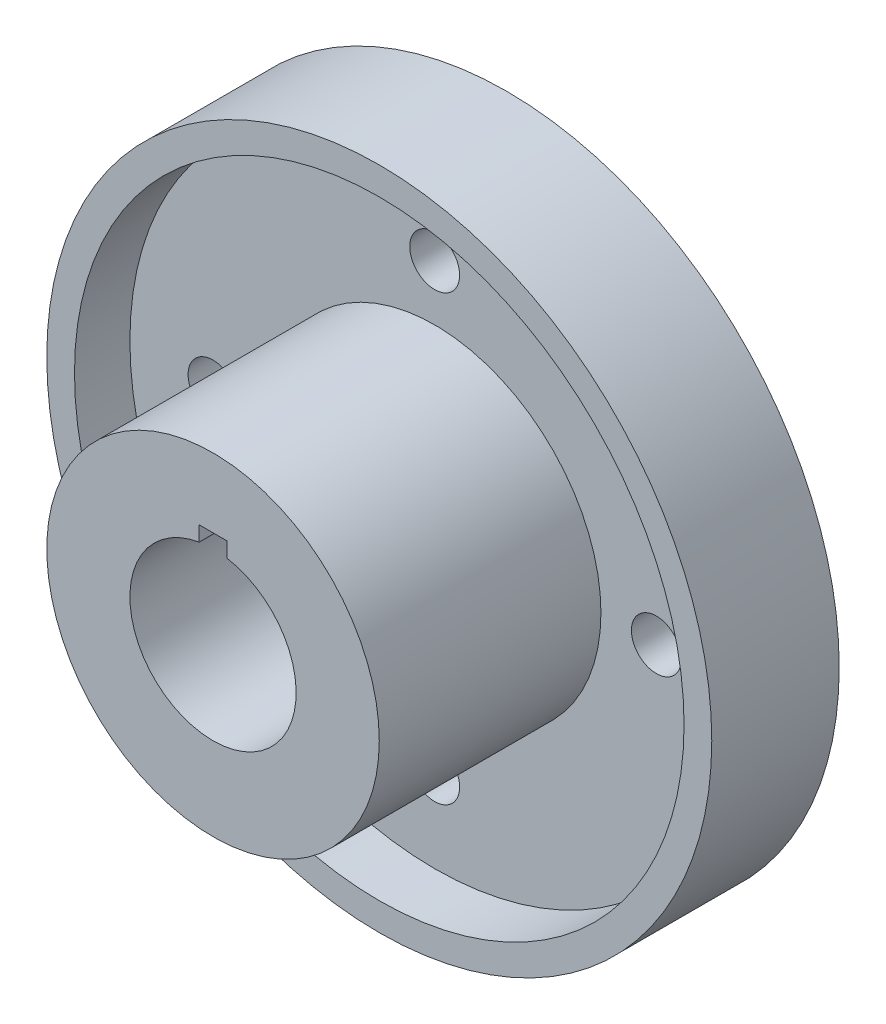
ISO-10303-21;
HEADER;
FILE_DESCRIPTION(('STEP AP214'),'2;1');
FILE_NAME('part.step','',(''),(''),'','','');
FILE_SCHEMA(('AUTOMOTIVE_DESIGN { 1 0 10303 214 1 1 1 1 }'));
ENDSEC;
DATA;
#1=APPLICATION_CONTEXT('core data for automotive mechanical design processes');
#2=APPLICATION_PROTOCOL_DEFINITION('international standard','automotive_design',2000,#1);
#3=PRODUCT_CONTEXT('',#1,'mechanical');
#4=PRODUCT('Part','Part','',(#3));
#5=PRODUCT_RELATED_PRODUCT_CATEGORY('part','',(#4));
#6=PRODUCT_DEFINITION_FORMATION('','',#4);
#7=PRODUCT_DEFINITION_CONTEXT('part definition',#1,'design');
#8=PRODUCT_DEFINITION('design','',#6,#7);
#9=PRODUCT_DEFINITION_SHAPE('','',#8);
#10=(LENGTH_UNIT() NAMED_UNIT(*) SI_UNIT(.MILLI.,.METRE.));
#11=(NAMED_UNIT(*) PLANE_ANGLE_UNIT() SI_UNIT($,.RADIAN.));
#12=(NAMED_UNIT(*) SI_UNIT($,.STERADIAN.) SOLID_ANGLE_UNIT());
#13=UNCERTAINTY_MEASURE_WITH_UNIT(LENGTH_MEASURE(1.E-05),#10,'distance_accuracy_value','');
#14=(GEOMETRIC_REPRESENTATION_CONTEXT(3) GLOBAL_UNCERTAINTY_ASSIGNED_CONTEXT((#13)) GLOBAL_UNIT_ASSIGNED_CONTEXT((#10,
#11,#12)) REPRESENTATION_CONTEXT('',''));
#15=CARTESIAN_POINT('',(0.,0.,0.));
#16=DIRECTION('',(0.,0.,1.));
#17=DIRECTION('',(1.,0.,0.));
#18=AXIS2_PLACEMENT_3D('',#15,#16,#17);
#19=CARTESIAN_POINT('',(0.,15.,53.));
#20=DIRECTION('',(0.,0.,-1.));
#21=DIRECTION('',(-1.,0.,0.));
#22=AXIS2_PLACEMENT_3D('',#19,#20,#21);
#23=PLANE('',#22);
#24=CARTESIAN_POINT('',(0.,0.,53.));
#25=DIRECTION('',(0.,0.,1.));
#26=DIRECTION('',(1.,0.,0.));
#27=AXIS2_PLACEMENT_3D('',#24,#25,#26);
#28=CIRCLE('',#27,15.);
#29=CARTESIAN_POINT('',(-2.5,14.790199457749,53.));
#30=VERTEX_POINT('',#29);
#31=CARTESIAN_POINT('',(2.5,14.790199457749,53.));
#32=VERTEX_POINT('',#31);
#33=EDGE_CURVE('E124',#30,#32,#28,.T.);
#34=ORIENTED_EDGE('',*,*,#33,.F.);
#35=DIRECTION('',(0.,-1.,0.));
#36=VECTOR('',#35,1.);
#37=CARTESIAN_POINT('',(-2.5,12.5,53.));
#38=LINE('',#37,#36);
#39=CARTESIAN_POINT('',(-2.5,17.5,53.));
#40=VERTEX_POINT('',#39);
#41=EDGE_CURVE('E109',#40,#30,#38,.T.);
#42=ORIENTED_EDGE('',*,*,#41,.F.);
#43=DIRECTION('',(-1.,0.,0.));
#44=VECTOR('',#43,1.);
#45=CARTESIAN_POINT('',(-2.5,17.5,53.));
#46=LINE('',#45,#44);
#47=CARTESIAN_POINT('',(2.5,17.5,53.));
#48=VERTEX_POINT('',#47);
#49=EDGE_CURVE('E96',#48,#40,#46,.T.);
#50=ORIENTED_EDGE('',*,*,#49,.F.);
#51=DIRECTION('',(0.,1.,0.));
#52=VECTOR('',#51,1.);
#53=CARTESIAN_POINT('',(2.5,12.5,53.));
#54=LINE('',#53,#52);
#55=EDGE_CURVE('E102',#32,#48,#54,.T.);
#56=ORIENTED_EDGE('',*,*,#55,.F.);
#57=EDGE_LOOP('',(#34,#42,#50,#56));
#58=FACE_BOUND('',#57,.T.);
#59=CARTESIAN_POINT('',(0.,0.,53.));
#60=DIRECTION('',(0.,0.,1.));
#61=DIRECTION('',(1.,0.,0.));
#62=AXIS2_PLACEMENT_3D('',#59,#60,#61);
#63=CIRCLE('',#62,30.);
#64=CARTESIAN_POINT('',(30.,0.,53.));
#65=VERTEX_POINT('',#64);
#66=EDGE_CURVE('E159',#65,#65,#63,.T.);
#67=ORIENTED_EDGE('',*,*,#66,.T.);
#68=EDGE_LOOP('',(#67));
#69=FACE_BOUND('',#68,.T.);
#70=ADVANCED_FACE('F49',(#58,#69),#23,.F.);
#71=CARTESIAN_POINT('',(0.,0.,0.));
#72=DIRECTION('',(0.,0.,1.));
#73=DIRECTION('',(1.,0.,0.));
#74=AXIS2_PLACEMENT_3D('',#71,#72,#73);
#75=CYLINDRICAL_SURFACE('',#74,30.);
#76=ORIENTED_EDGE('',*,*,#66,.F.);
#77=EDGE_LOOP('',(#76));
#78=FACE_BOUND('',#77,.T.);
#79=CARTESIAN_POINT('',(0.,0.,13.));
#80=DIRECTION('',(0.,0.,1.));
#81=DIRECTION('',(1.,0.,0.));
#82=AXIS2_PLACEMENT_3D('',#79,#80,#81);
#83=CIRCLE('',#82,30.);
#84=CARTESIAN_POINT('',(30.,0.,13.));
#85=VERTEX_POINT('',#84);
#86=EDGE_CURVE('E155',#85,#85,#83,.T.);
#87=ORIENTED_EDGE('',*,*,#86,.T.);
#88=EDGE_LOOP('',(#87));
#89=FACE_BOUND('',#88,.T.);
#90=ADVANCED_FACE('F222',(#78,#89),#75,.T.);
#91=CARTESIAN_POINT('',(0.,30.,13.));
#92=DIRECTION('',(0.,0.,-1.));
#93=DIRECTION('',(-1.,0.,0.));
#94=AXIS2_PLACEMENT_3D('',#91,#92,#93);
#95=PLANE('',#94);
#96=CARTESIAN_POINT('',(40.,4.18977760661176E-13,13.));
#97=DIRECTION('',(0.,0.,1.));
#98=DIRECTION('',(1.,0.,0.));
#99=AXIS2_PLACEMENT_3D('',#96,#97,#98);
#100=CIRCLE('',#99,4.49999999999999);
#101=CARTESIAN_POINT('',(44.5,4.18977760661176E-13,13.));
#102=VERTEX_POINT('',#101);
#103=EDGE_CURVE('E194',#102,#102,#100,.T.);
#104=ORIENTED_EDGE('',*,*,#103,.F.);
#105=EDGE_LOOP('',(#104));
#106=FACE_BOUND('',#105,.T.);
#107=CARTESIAN_POINT('',(0.,-40.,13.));
#108=DIRECTION('',(0.,0.,1.));
#109=DIRECTION('',(1.,0.,0.));
#110=AXIS2_PLACEMENT_3D('',#107,#108,#109);
#111=CIRCLE('',#110,4.49999999999999);
#112=CARTESIAN_POINT('',(4.49999999999999,-40.,13.));
#113=VERTEX_POINT('',#112);
#114=EDGE_CURVE('E179',#113,#113,#111,.T.);
#115=ORIENTED_EDGE('',*,*,#114,.F.);
#116=EDGE_LOOP('',(#115));
#117=FACE_BOUND('',#116,.T.);
#118=CARTESIAN_POINT('',(-40.,-1.39659253553725E-13,13.));
#119=DIRECTION('',(0.,0.,1.));
#120=DIRECTION('',(1.,0.,0.));
#121=AXIS2_PLACEMENT_3D('',#118,#119,#120);
#122=CIRCLE('',#121,4.49999999999999);
#123=CARTESIAN_POINT('',(-35.5,-1.39659253553725E-13,13.));
#124=VERTEX_POINT('',#123);
#125=EDGE_CURVE('E175',#124,#124,#122,.T.);
#126=ORIENTED_EDGE('',*,*,#125,.F.);
#127=EDGE_LOOP('',(#126));
#128=FACE_BOUND('',#127,.T.);
#129=CARTESIAN_POINT('',(0.,40.,13.));
#130=DIRECTION('',(0.,0.,1.));
#131=DIRECTION('',(1.,0.,0.));
#132=AXIS2_PLACEMENT_3D('',#129,#130,#131);
#133=CIRCLE('',#132,4.49999999999999);
#134=CARTESIAN_POINT('',(4.49999999999999,40.,13.));
#135=VERTEX_POINT('',#134);
#136=EDGE_CURVE('E171',#135,#135,#133,.T.);
#137=ORIENTED_EDGE('',*,*,#136,.F.);
#138=EDGE_LOOP('',(#137));
#139=FACE_BOUND('',#138,.T.);
#140=ORIENTED_EDGE('',*,*,#86,.F.);
#141=EDGE_LOOP('',(#140));
#142=FACE_BOUND('',#141,.T.);
#143=CARTESIAN_POINT('',(0.,0.,13.));
#144=DIRECTION('',(0.,0.,1.));
#145=DIRECTION('',(1.,0.,0.));
#146=AXIS2_PLACEMENT_3D('',#143,#144,#145);
#147=CIRCLE('',#146,55.);
#148=CARTESIAN_POINT('',(55.,0.,13.));
#149=VERTEX_POINT('',#148);
#150=EDGE_CURVE('E151',#149,#149,#147,.T.);
#151=ORIENTED_EDGE('',*,*,#150,.T.);
#152=EDGE_LOOP('',(#151));
#153=FACE_BOUND('',#152,.T.);
#154=ADVANCED_FACE('F226',(#106,#117,#128,#139,#142,#153),#95,.F.);
#155=CARTESIAN_POINT('',(0.,0.,0.));
#156=DIRECTION('',(0.,0.,1.));
#157=DIRECTION('',(1.,0.,0.));
#158=AXIS2_PLACEMENT_3D('',#155,#156,#157);
#159=CYLINDRICAL_SURFACE('',#158,55.);
#160=ORIENTED_EDGE('',*,*,#150,.F.);
#161=EDGE_LOOP('',(#160));
#162=FACE_BOUND('',#161,.T.);
#163=CARTESIAN_POINT('',(0.,0.,23.));
#164=DIRECTION('',(0.,0.,1.));
#165=DIRECTION('',(1.,0.,0.));
#166=AXIS2_PLACEMENT_3D('',#163,#164,#165);
#167=CIRCLE('',#166,55.);
#168=CARTESIAN_POINT('',(55.,0.,23.));
#169=VERTEX_POINT('',#168);
#170=EDGE_CURVE('E147',#169,#169,#167,.T.);
#171=ORIENTED_EDGE('',*,*,#170,.T.);
#172=EDGE_LOOP('',(#171));
#173=FACE_BOUND('',#172,.T.);
#174=ADVANCED_FACE('F231',(#162,#173),#159,.F.);
#175=CARTESIAN_POINT('',(0.,55.,23.));
#176=DIRECTION('',(0.,0.,-1.));
#177=DIRECTION('',(-1.,0.,0.));
#178=AXIS2_PLACEMENT_3D('',#175,#176,#177);
#179=PLANE('',#178);
#180=ORIENTED_EDGE('',*,*,#170,.F.);
#181=EDGE_LOOP('',(#180));
#182=FACE_BOUND('',#181,.T.);
#183=CARTESIAN_POINT('',(0.,0.,23.));
#184=DIRECTION('',(0.,0.,1.));
#185=DIRECTION('',(1.,0.,0.));
#186=AXIS2_PLACEMENT_3D('',#183,#184,#185);
#187=CIRCLE('',#186,60.);
#188=CARTESIAN_POINT('',(60.,0.,23.));
#189=VERTEX_POINT('',#188);
#190=EDGE_CURVE('E143',#189,#189,#187,.T.);
#191=ORIENTED_EDGE('',*,*,#190,.T.);
#192=EDGE_LOOP('',(#191));
#193=FACE_BOUND('',#192,.T.);
#194=ADVANCED_FACE('F238',(#182,#193),#179,.F.);
#195=CARTESIAN_POINT('',(0.,0.,0.));
#196=DIRECTION('',(0.,0.,1.));
#197=DIRECTION('',(1.,0.,0.));
#198=AXIS2_PLACEMENT_3D('',#195,#196,#197);
#199=CYLINDRICAL_SURFACE('',#198,60.);
#200=ORIENTED_EDGE('',*,*,#190,.F.);
#201=EDGE_LOOP('',(#200));
#202=FACE_BOUND('',#201,.T.);
#203=CARTESIAN_POINT('',(0.,0.,0.));
#204=DIRECTION('',(0.,0.,1.));
#205=DIRECTION('',(1.,0.,0.));
#206=AXIS2_PLACEMENT_3D('',#203,#204,#205);
#207=CIRCLE('',#206,60.);
#208=CARTESIAN_POINT('',(60.,0.,0.));
#209=VERTEX_POINT('',#208);
#210=EDGE_CURVE('E139',#209,#209,#207,.T.);
#211=ORIENTED_EDGE('',*,*,#210,.T.);
#212=EDGE_LOOP('',(#211));
#213=FACE_BOUND('',#212,.T.);
#214=ADVANCED_FACE('F242',(#202,#213),#199,.T.);
#215=CARTESIAN_POINT('',(0.,60.,0.));
#216=DIRECTION('',(0.,0.,1.));
#217=DIRECTION('',(1.,0.,0.));
#218=AXIS2_PLACEMENT_3D('',#215,#216,#217);
#219=PLANE('',#218);
#220=ORIENTED_EDGE('',*,*,#210,.F.);
#221=EDGE_LOOP('',(#220));
#222=FACE_BOUND('',#221,.T.);
#223=CARTESIAN_POINT('',(0.,0.,0.));
#224=DIRECTION('',(0.,0.,1.));
#225=DIRECTION('',(1.,0.,0.));
#226=AXIS2_PLACEMENT_3D('',#223,#224,#225);
#227=CIRCLE('',#226,55.);
#228=CARTESIAN_POINT('',(55.,0.,0.));
#229=VERTEX_POINT('',#228);
#230=EDGE_CURVE('E135',#229,#229,#227,.T.);
#231=ORIENTED_EDGE('',*,*,#230,.T.);
#232=EDGE_LOOP('',(#231));
#233=FACE_BOUND('',#232,.T.);
#234=ADVANCED_FACE('F218',(#222,#233),#219,.F.);
#235=CARTESIAN_POINT('',(0.,0.,0.));
#236=DIRECTION('',(0.,0.,1.));
#237=DIRECTION('',(1.,0.,0.));
#238=AXIS2_PLACEMENT_3D('',#235,#236,#237);
#239=CYLINDRICAL_SURFACE('',#238,55.);
#240=ORIENTED_EDGE('',*,*,#230,.F.);
#241=EDGE_LOOP('',(#240));
#242=FACE_BOUND('',#241,.T.);
#243=CARTESIAN_POINT('',(0.,0.,3.));
#244=DIRECTION('',(0.,0.,1.));
#245=DIRECTION('',(1.,0.,0.));
#246=AXIS2_PLACEMENT_3D('',#243,#244,#245);
#247=CIRCLE('',#246,55.);
#248=CARTESIAN_POINT('',(55.,0.,3.));
#249=VERTEX_POINT('',#248);
#250=EDGE_CURVE('E131',#249,#249,#247,.T.);
#251=ORIENTED_EDGE('',*,*,#250,.T.);
#252=EDGE_LOOP('',(#251));
#253=FACE_BOUND('',#252,.T.);
#254=ADVANCED_FACE('F208',(#242,#253),#239,.F.);
#255=CARTESIAN_POINT('',(0.,33.885514375046,2.99999999999999));
#256=DIRECTION('',(0.,0.,1.));
#257=DIRECTION('',(1.,0.,0.));
#258=AXIS2_PLACEMENT_3D('',#255,#256,#257);
#259=PLANE('',#258);
#260=CARTESIAN_POINT('',(40.,4.18977760661176E-13,3.));
#261=DIRECTION('',(0.,0.,1.));
#262=DIRECTION('',(1.,0.,0.));
#263=AXIS2_PLACEMENT_3D('',#260,#261,#262);
#264=CIRCLE('',#263,4.49999999999999);
#265=CARTESIAN_POINT('',(44.5,4.18977760661176E-13,3.));
#266=VERTEX_POINT('',#265);
#267=EDGE_CURVE('E52',#266,#266,#264,.T.);
#268=ORIENTED_EDGE('',*,*,#267,.T.);
#269=EDGE_LOOP('',(#268));
#270=FACE_BOUND('',#269,.T.);
#271=CARTESIAN_POINT('',(0.,-40.,3.));
#272=DIRECTION('',(0.,0.,1.));
#273=DIRECTION('',(1.,0.,0.));
#274=AXIS2_PLACEMENT_3D('',#271,#272,#273);
#275=CIRCLE('',#274,4.49999999999999);
#276=CARTESIAN_POINT('',(4.49999999999999,-40.,3.));
#277=VERTEX_POINT('',#276);
#278=EDGE_CURVE('E176',#277,#277,#275,.T.);
#279=ORIENTED_EDGE('',*,*,#278,.T.);
#280=EDGE_LOOP('',(#279));
#281=FACE_BOUND('',#280,.T.);
#282=CARTESIAN_POINT('',(-40.,-1.39659253553725E-13,3.));
#283=DIRECTION('',(0.,0.,1.));
#284=DIRECTION('',(1.,0.,0.));
#285=AXIS2_PLACEMENT_3D('',#282,#283,#284);
#286=CIRCLE('',#285,4.49999999999999);
#287=CARTESIAN_POINT('',(-35.5,-1.39659253553725E-13,3.));
#288=VERTEX_POINT('',#287);
#289=EDGE_CURVE('E172',#288,#288,#286,.T.);
#290=ORIENTED_EDGE('',*,*,#289,.T.);
#291=EDGE_LOOP('',(#290));
#292=FACE_BOUND('',#291,.T.);
#293=CARTESIAN_POINT('',(0.,40.,3.));
#294=DIRECTION('',(0.,0.,1.));
#295=DIRECTION('',(1.,0.,0.));
#296=AXIS2_PLACEMENT_3D('',#293,#294,#295);
#297=CIRCLE('',#296,4.49999999999999);
#298=CARTESIAN_POINT('',(4.49999999999999,40.,3.));
#299=VERTEX_POINT('',#298);
#300=EDGE_CURVE('E167',#299,#299,#297,.T.);
#301=ORIENTED_EDGE('',*,*,#300,.T.);
#302=EDGE_LOOP('',(#301));
#303=FACE_BOUND('',#302,.T.);
#304=ORIENTED_EDGE('',*,*,#250,.F.);
#305=EDGE_LOOP('',(#304));
#306=FACE_BOUND('',#305,.T.);
#307=DIRECTION('',(-1.,0.,0.));
#308=VECTOR('',#307,1.);
#309=CARTESIAN_POINT('',(0.,17.5,2.99999999999999));
#310=LINE('',#309,#308);
#311=CARTESIAN_POINT('',(2.5,17.5,2.99999999999999));
#312=VERTEX_POINT('',#311);
#313=CARTESIAN_POINT('',(-2.5,17.5,2.99999999999999));
#314=VERTEX_POINT('',#313);
#315=EDGE_CURVE('E11',#312,#314,#310,.T.);
#316=ORIENTED_EDGE('',*,*,#315,.T.);
#317=DIRECTION('',(0.,-1.,0.));
#318=VECTOR('',#317,1.);
#319=CARTESIAN_POINT('',(-2.5,33.885514375046,2.99999999999999));
#320=LINE('',#319,#318);
#321=CARTESIAN_POINT('',(-2.5,14.790199457749,2.99999999999999));
#322=VERTEX_POINT('',#321);
#323=EDGE_CURVE('E121',#314,#322,#320,.T.);
#324=ORIENTED_EDGE('',*,*,#323,.T.);
#325=CARTESIAN_POINT('',(0.,0.,2.99999999999999));
#326=DIRECTION('',(0.,0.,1.));
#327=DIRECTION('',(1.,0.,0.));
#328=AXIS2_PLACEMENT_3D('',#325,#326,#327);
#329=CIRCLE('',#328,15.);
#330=CARTESIAN_POINT('',(2.5,14.790199457749,2.99999999999999));
#331=VERTEX_POINT('',#330);
#332=EDGE_CURVE('E127',#322,#331,#329,.T.);
#333=ORIENTED_EDGE('',*,*,#332,.T.);
#334=DIRECTION('',(0.,1.,0.));
#335=VECTOR('',#334,1.);
#336=CARTESIAN_POINT('',(2.5,33.885514375046,2.99999999999999));
#337=LINE('',#336,#335);
#338=EDGE_CURVE('E66',#331,#312,#337,.T.);
#339=ORIENTED_EDGE('',*,*,#338,.T.);
#340=EDGE_LOOP('',(#316,#324,#333,#339));
#341=FACE_BOUND('',#340,.T.);
#342=ADVANCED_FACE('F206',(#270,#281,#292,#303,#306,#341),#259,.F.);
#343=CARTESIAN_POINT('',(0.,0.,0.));
#344=DIRECTION('',(0.,0.,1.));
#345=DIRECTION('',(1.,0.,0.));
#346=AXIS2_PLACEMENT_3D('',#343,#344,#345);
#347=CYLINDRICAL_SURFACE('',#346,15.);
#348=ORIENTED_EDGE('',*,*,#332,.F.);
#349=DIRECTION('',(0.,0.,1.));
#350=VECTOR('',#349,1.);
#351=CARTESIAN_POINT('',(-2.5,14.790199457749,0.));
#352=LINE('',#351,#350);
#353=EDGE_CURVE('E58',#322,#30,#352,.T.);
#354=ORIENTED_EDGE('',*,*,#353,.T.);
#355=ORIENTED_EDGE('',*,*,#33,.T.);
#356=DIRECTION('',(0.,0.,1.));
#357=VECTOR('',#356,1.);
#358=CARTESIAN_POINT('',(2.5,14.790199457749,0.));
#359=LINE('',#358,#357);
#360=EDGE_CURVE('E104',#32,#331,#359,.F.);
#361=ORIENTED_EDGE('',*,*,#360,.T.);
#362=EDGE_LOOP('',(#348,#354,#355,#361));
#363=FACE_BOUND('',#362,.T.);
#364=ADVANCED_FACE('F204',(#363),#347,.F.);
#365=CARTESIAN_POINT('',(-2.5,17.5,0.));
#366=DIRECTION('',(0.,1.,0.));
#367=DIRECTION('',(0.,0.,1.));
#368=AXIS2_PLACEMENT_3D('',#365,#366,#367);
#369=PLANE('',#368);
#370=DIRECTION('',(0.,0.,1.));
#371=VECTOR('',#370,1.);
#372=CARTESIAN_POINT('',(2.5,17.5,0.));
#373=LINE('',#372,#371);
#374=EDGE_CURVE('E91',#312,#48,#373,.T.);
#375=ORIENTED_EDGE('',*,*,#374,.T.);
#376=ORIENTED_EDGE('',*,*,#49,.T.);
#377=DIRECTION('',(0.,0.,1.));
#378=VECTOR('',#377,1.);
#379=CARTESIAN_POINT('',(-2.5,17.5,0.));
#380=LINE('',#379,#378);
#381=EDGE_CURVE('E99',#314,#40,#380,.T.);
#382=ORIENTED_EDGE('',*,*,#381,.F.);
#383=ORIENTED_EDGE('',*,*,#315,.F.);
#384=EDGE_LOOP('',(#375,#376,#382,#383));
#385=FACE_BOUND('',#384,.T.);
#386=ADVANCED_FACE('F93',(#385),#369,.F.);
#387=CARTESIAN_POINT('',(-2.5,12.5,0.));
#388=DIRECTION('',(-1.,0.,0.));
#389=DIRECTION('',(0.,0.,1.));
#390=AXIS2_PLACEMENT_3D('',#387,#388,#389);
#391=PLANE('',#390);
#392=ORIENTED_EDGE('',*,*,#381,.T.);
#393=ORIENTED_EDGE('',*,*,#41,.T.);
#394=ORIENTED_EDGE('',*,*,#353,.F.);
#395=ORIENTED_EDGE('',*,*,#323,.F.);
#396=EDGE_LOOP('',(#392,#393,#394,#395));
#397=FACE_BOUND('',#396,.T.);
#398=ADVANCED_FACE('F201',(#397),#391,.F.);
#399=CARTESIAN_POINT('',(2.5,12.5,0.));
#400=DIRECTION('',(1.,0.,0.));
#401=DIRECTION('',(0.,0.,-1.));
#402=AXIS2_PLACEMENT_3D('',#399,#400,#401);
#403=PLANE('',#402);
#404=ORIENTED_EDGE('',*,*,#360,.F.);
#405=ORIENTED_EDGE('',*,*,#55,.T.);
#406=ORIENTED_EDGE('',*,*,#374,.F.);
#407=ORIENTED_EDGE('',*,*,#338,.F.);
#408=EDGE_LOOP('',(#404,#405,#406,#407));
#409=FACE_BOUND('',#408,.T.);
#410=ADVANCED_FACE('F103',(#409),#403,.F.);
#411=CARTESIAN_POINT('',(0.,40.,13.));
#412=DIRECTION('',(0.,0.,1.));
#413=DIRECTION('',(1.,0.,0.));
#414=AXIS2_PLACEMENT_3D('',#411,#412,#413);
#415=CYLINDRICAL_SURFACE('',#414,4.49999999999999);
#416=ORIENTED_EDGE('',*,*,#136,.T.);
#417=EDGE_LOOP('',(#416));
#418=FACE_BOUND('',#417,.T.);
#419=ORIENTED_EDGE('',*,*,#300,.F.);
#420=EDGE_LOOP('',(#419));
#421=FACE_BOUND('',#420,.T.);
#422=ADVANCED_FACE('F304',(#418,#421),#415,.F.);
#423=CARTESIAN_POINT('',(-40.,-1.39659253553725E-13,13.));
#424=DIRECTION('',(0.,0.,1.));
#425=DIRECTION('',(1.,0.,0.));
#426=AXIS2_PLACEMENT_3D('',#423,#424,#425);
#427=CYLINDRICAL_SURFACE('',#426,4.49999999999999);
#428=ORIENTED_EDGE('',*,*,#125,.T.);
#429=EDGE_LOOP('',(#428));
#430=FACE_BOUND('',#429,.T.);
#431=ORIENTED_EDGE('',*,*,#289,.F.);
#432=EDGE_LOOP('',(#431));
#433=FACE_BOUND('',#432,.T.);
#434=ADVANCED_FACE('F313',(#430,#433),#427,.F.);
#435=CARTESIAN_POINT('',(0.,-40.,13.));
#436=DIRECTION('',(0.,0.,1.));
#437=DIRECTION('',(1.,0.,0.));
#438=AXIS2_PLACEMENT_3D('',#435,#436,#437);
#439=CYLINDRICAL_SURFACE('',#438,4.49999999999999);
#440=ORIENTED_EDGE('',*,*,#114,.T.);
#441=EDGE_LOOP('',(#440));
#442=FACE_BOUND('',#441,.T.);
#443=ORIENTED_EDGE('',*,*,#278,.F.);
#444=EDGE_LOOP('',(#443));
#445=FACE_BOUND('',#444,.T.);
#446=ADVANCED_FACE('F322',(#442,#445),#439,.F.);
#447=CARTESIAN_POINT('',(40.,4.18977760661176E-13,13.));
#448=DIRECTION('',(0.,0.,1.));
#449=DIRECTION('',(1.,0.,0.));
#450=AXIS2_PLACEMENT_3D('',#447,#448,#449);
#451=CYLINDRICAL_SURFACE('',#450,4.49999999999999);
#452=ORIENTED_EDGE('',*,*,#103,.T.);
#453=EDGE_LOOP('',(#452));
#454=FACE_BOUND('',#453,.T.);
#455=ORIENTED_EDGE('',*,*,#267,.F.);
#456=EDGE_LOOP('',(#455));
#457=FACE_BOUND('',#456,.T.);
#458=ADVANCED_FACE('F332',(#454,#457),#451,.F.);
#459=CLOSED_SHELL('',(#70,#90,#154,#174,#194,#214,#234,#254,#342,#364,#386,#398,#410,#422,#434,
#446,#458));
#460=MANIFOLD_SOLID_BREP('B2',#459);
#461=ADVANCED_BREP_SHAPE_REPRESENTATION('',(#18,#460),#14);
#462=SHAPE_DEFINITION_REPRESENTATION(#9,#461);
ENDSEC;
END-ISO-10303-21;
